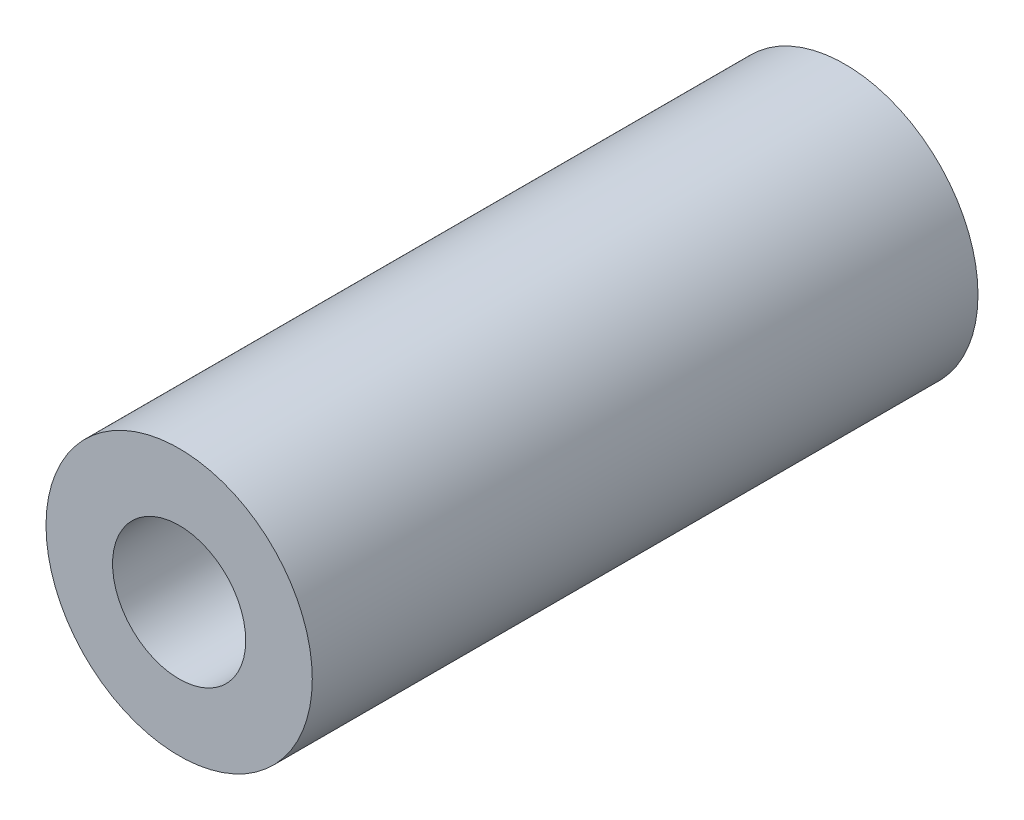
ISO-10303-21;
HEADER;
FILE_DESCRIPTION(('STEP AP214'),'2;1');
FILE_NAME('part.step','',(''),(''),'','','');
FILE_SCHEMA(('AUTOMOTIVE_DESIGN { 1 0 10303 214 1 1 1 1 }'));
ENDSEC;
DATA;
#1=APPLICATION_CONTEXT('core data for automotive mechanical design processes');
#2=APPLICATION_PROTOCOL_DEFINITION('international standard','automotive_design',2000,#1);
#3=PRODUCT_CONTEXT('',#1,'mechanical');
#4=PRODUCT('Part','Part','',(#3));
#5=PRODUCT_RELATED_PRODUCT_CATEGORY('part','',(#4));
#6=PRODUCT_DEFINITION_FORMATION('','',#4);
#7=PRODUCT_DEFINITION_CONTEXT('part definition',#1,'design');
#8=PRODUCT_DEFINITION('design','',#6,#7);
#9=PRODUCT_DEFINITION_SHAPE('','',#8);
#10=(LENGTH_UNIT() NAMED_UNIT(*) SI_UNIT(.MILLI.,.METRE.));
#11=(NAMED_UNIT(*) PLANE_ANGLE_UNIT() SI_UNIT($,.RADIAN.));
#12=(NAMED_UNIT(*) SI_UNIT($,.STERADIAN.) SOLID_ANGLE_UNIT());
#13=UNCERTAINTY_MEASURE_WITH_UNIT(LENGTH_MEASURE(1.E-05),#10,'distance_accuracy_value','');
#14=(GEOMETRIC_REPRESENTATION_CONTEXT(3) GLOBAL_UNCERTAINTY_ASSIGNED_CONTEXT((#13)) GLOBAL_UNIT_ASSIGNED_CONTEXT((#10,
#11,#12)) REPRESENTATION_CONTEXT('',''));
#15=CARTESIAN_POINT('',(0.,0.,0.));
#16=DIRECTION('',(0.,0.,1.));
#17=DIRECTION('',(1.,0.,0.));
#18=AXIS2_PLACEMENT_3D('',#15,#16,#17);
#19=CARTESIAN_POINT('',(0.,0.,20.));
#20=DIRECTION('',(0.,0.,1.));
#21=DIRECTION('',(1.,0.,0.));
#22=AXIS2_PLACEMENT_3D('',#19,#20,#21);
#23=PLANE('',#22);
#24=CARTESIAN_POINT('',(0.,0.,20.));
#25=DIRECTION('',(0.,0.,1.));
#26=DIRECTION('',(1.,0.,0.));
#27=AXIS2_PLACEMENT_3D('',#24,#25,#26);
#28=CIRCLE('',#27,4.);
#29=CARTESIAN_POINT('',(4.,0.,20.));
#30=VERTEX_POINT('',#29);
#31=EDGE_CURVE('E10',#30,#30,#28,.T.);
#32=ORIENTED_EDGE('',*,*,#31,.T.);
#33=EDGE_LOOP('',(#32));
#34=FACE_BOUND('',#33,.T.);
#35=CARTESIAN_POINT('',(0.,0.,20.));
#36=DIRECTION('',(0.,0.,1.));
#37=DIRECTION('',(1.,0.,0.));
#38=AXIS2_PLACEMENT_3D('',#35,#36,#37);
#39=CIRCLE('',#38,2.);
#40=CARTESIAN_POINT('',(2.,0.,20.));
#41=VERTEX_POINT('',#40);
#42=EDGE_CURVE('E42',#41,#41,#39,.T.);
#43=ORIENTED_EDGE('',*,*,#42,.F.);
#44=EDGE_LOOP('',(#43));
#45=FACE_BOUND('',#44,.T.);
#46=ADVANCED_FACE('F31',(#34,#45),#23,.T.);
#47=CARTESIAN_POINT('',(0.,0.,0.));
#48=DIRECTION('',(0.,0.,1.));
#49=DIRECTION('',(1.,0.,0.));
#50=AXIS2_PLACEMENT_3D('',#47,#48,#49);
#51=PLANE('',#50);
#52=CARTESIAN_POINT('',(0.,0.,0.));
#53=DIRECTION('',(0.,0.,1.));
#54=DIRECTION('',(1.,0.,0.));
#55=AXIS2_PLACEMENT_3D('',#52,#53,#54);
#56=CIRCLE('',#55,4.);
#57=CARTESIAN_POINT('',(4.,0.,0.));
#58=VERTEX_POINT('',#57);
#59=EDGE_CURVE('E35',#58,#58,#56,.T.);
#60=ORIENTED_EDGE('',*,*,#59,.F.);
#61=EDGE_LOOP('',(#60));
#62=FACE_BOUND('',#61,.T.);
#63=CARTESIAN_POINT('',(0.,0.,0.));
#64=DIRECTION('',(0.,0.,1.));
#65=DIRECTION('',(1.,0.,0.));
#66=AXIS2_PLACEMENT_3D('',#63,#64,#65);
#67=CIRCLE('',#66,2.);
#68=CARTESIAN_POINT('',(2.,0.,0.));
#69=VERTEX_POINT('',#68);
#70=EDGE_CURVE('E44',#69,#69,#67,.T.);
#71=ORIENTED_EDGE('',*,*,#70,.T.);
#72=EDGE_LOOP('',(#71));
#73=FACE_BOUND('',#72,.T.);
#74=ADVANCED_FACE('F54',(#62,#73),#51,.F.);
#75=CARTESIAN_POINT('',(0.,0.,20.));
#76=DIRECTION('',(0.,0.,-1.));
#77=DIRECTION('',(-1.,0.,0.));
#78=AXIS2_PLACEMENT_3D('',#75,#76,#77);
#79=CYLINDRICAL_SURFACE('',#78,4.);
#80=ORIENTED_EDGE('',*,*,#31,.F.);
#81=EDGE_LOOP('',(#80));
#82=FACE_BOUND('',#81,.T.);
#83=ORIENTED_EDGE('',*,*,#59,.T.);
#84=EDGE_LOOP('',(#83));
#85=FACE_BOUND('',#84,.T.);
#86=ADVANCED_FACE('F33',(#82,#85),#79,.T.);
#87=CARTESIAN_POINT('',(0.,0.,20.));
#88=DIRECTION('',(0.,0.,-1.));
#89=DIRECTION('',(-1.,0.,0.));
#90=AXIS2_PLACEMENT_3D('',#87,#88,#89);
#91=CYLINDRICAL_SURFACE('',#90,2.);
#92=ORIENTED_EDGE('',*,*,#42,.T.);
#93=EDGE_LOOP('',(#92));
#94=FACE_BOUND('',#93,.T.);
#95=ORIENTED_EDGE('',*,*,#70,.F.);
#96=EDGE_LOOP('',(#95));
#97=FACE_BOUND('',#96,.T.);
#98=ADVANCED_FACE('F50',(#94,#97),#91,.F.);
#99=CLOSED_SHELL('',(#46,#74,#86,#98));
#100=MANIFOLD_SOLID_BREP('B2',#99);
#101=ADVANCED_BREP_SHAPE_REPRESENTATION('',(#18,#100),#14);
#102=SHAPE_DEFINITION_REPRESENTATION(#9,#101);
ENDSEC;
END-ISO-10303-21;
